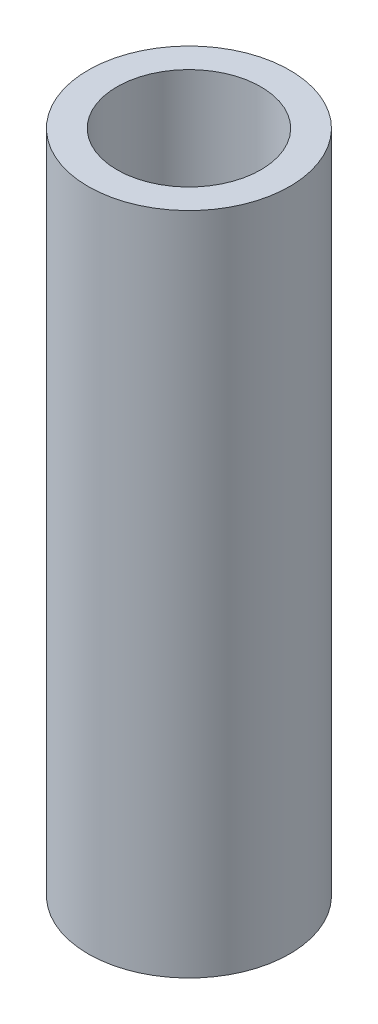
ISO-10303-21;
HEADER;
FILE_DESCRIPTION(('STEP AP214'),'2;1');
FILE_NAME('part.step','',(''),(''),'','','');
FILE_SCHEMA(('AUTOMOTIVE_DESIGN { 1 0 10303 214 1 1 1 1 }'));
ENDSEC;
DATA;
#1=APPLICATION_CONTEXT('core data for automotive mechanical design processes');
#2=APPLICATION_PROTOCOL_DEFINITION('international standard','automotive_design',2000,#1);
#3=PRODUCT_CONTEXT('',#1,'mechanical');
#4=PRODUCT('Part','Part','',(#3));
#5=PRODUCT_RELATED_PRODUCT_CATEGORY('part','',(#4));
#6=PRODUCT_DEFINITION_FORMATION('','',#4);
#7=PRODUCT_DEFINITION_CONTEXT('part definition',#1,'design');
#8=PRODUCT_DEFINITION('design','',#6,#7);
#9=PRODUCT_DEFINITION_SHAPE('','',#8);
#10=(LENGTH_UNIT() NAMED_UNIT(*) SI_UNIT(.MILLI.,.METRE.));
#11=(NAMED_UNIT(*) PLANE_ANGLE_UNIT() SI_UNIT($,.RADIAN.));
#12=(NAMED_UNIT(*) SI_UNIT($,.STERADIAN.) SOLID_ANGLE_UNIT());
#13=UNCERTAINTY_MEASURE_WITH_UNIT(LENGTH_MEASURE(1.E-05),#10,'distance_accuracy_value','');
#14=(GEOMETRIC_REPRESENTATION_CONTEXT(3) GLOBAL_UNCERTAINTY_ASSIGNED_CONTEXT((#13)) GLOBAL_UNIT_ASSIGNED_CONTEXT((#10,
#11,#12)) REPRESENTATION_CONTEXT('',''));
#15=CARTESIAN_POINT('',(0.,0.,0.));
#16=DIRECTION('',(0.,0.,1.));
#17=DIRECTION('',(1.,0.,0.));
#18=AXIS2_PLACEMENT_3D('',#15,#16,#17);
#19=CARTESIAN_POINT('',(0.,30.1498,0.));
#20=DIRECTION('',(0.,1.,0.));
#21=DIRECTION('',(0.,0.,1.));
#22=AXIS2_PLACEMENT_3D('',#19,#20,#21);
#23=PLANE('',#22);
#24=CARTESIAN_POINT('',(0.,30.1498,0.));
#25=DIRECTION('',(0.,1.,0.));
#26=DIRECTION('',(0.,0.,1.));
#27=AXIS2_PLACEMENT_3D('',#24,#25,#26);
#28=CIRCLE('',#27,4.572);
#29=CARTESIAN_POINT('',(0.,30.1498,4.572));
#30=VERTEX_POINT('',#29);
#31=EDGE_CURVE('E10',#30,#30,#28,.T.);
#32=ORIENTED_EDGE('',*,*,#31,.T.);
#33=EDGE_LOOP('',(#32));
#34=FACE_BOUND('',#33,.T.);
#35=CARTESIAN_POINT('',(0.,30.1498,0.));
#36=DIRECTION('',(0.,1.,0.));
#37=DIRECTION('',(0.,0.,1.));
#38=AXIS2_PLACEMENT_3D('',#35,#36,#37);
#39=CIRCLE('',#38,3.2639);
#40=CARTESIAN_POINT('',(0.,30.1498,3.2639));
#41=VERTEX_POINT('',#40);
#42=EDGE_CURVE('E42',#41,#41,#39,.T.);
#43=ORIENTED_EDGE('',*,*,#42,.F.);
#44=EDGE_LOOP('',(#43));
#45=FACE_BOUND('',#44,.T.);
#46=ADVANCED_FACE('F31',(#34,#45),#23,.T.);
#47=CARTESIAN_POINT('',(0.,0.,0.));
#48=DIRECTION('',(0.,1.,0.));
#49=DIRECTION('',(0.,0.,1.));
#50=AXIS2_PLACEMENT_3D('',#47,#48,#49);
#51=PLANE('',#50);
#52=CARTESIAN_POINT('',(0.,0.,0.));
#53=DIRECTION('',(0.,1.,0.));
#54=DIRECTION('',(0.,0.,1.));
#55=AXIS2_PLACEMENT_3D('',#52,#53,#54);
#56=CIRCLE('',#55,4.572);
#57=CARTESIAN_POINT('',(0.,0.,4.572));
#58=VERTEX_POINT('',#57);
#59=EDGE_CURVE('E35',#58,#58,#56,.T.);
#60=ORIENTED_EDGE('',*,*,#59,.F.);
#61=EDGE_LOOP('',(#60));
#62=FACE_BOUND('',#61,.T.);
#63=CARTESIAN_POINT('',(0.,0.,0.));
#64=DIRECTION('',(0.,1.,0.));
#65=DIRECTION('',(0.,0.,1.));
#66=AXIS2_PLACEMENT_3D('',#63,#64,#65);
#67=CIRCLE('',#66,3.2639);
#68=CARTESIAN_POINT('',(0.,0.,3.2639));
#69=VERTEX_POINT('',#68);
#70=EDGE_CURVE('E44',#69,#69,#67,.T.);
#71=ORIENTED_EDGE('',*,*,#70,.T.);
#72=EDGE_LOOP('',(#71));
#73=FACE_BOUND('',#72,.T.);
#74=ADVANCED_FACE('F54',(#62,#73),#51,.F.);
#75=CARTESIAN_POINT('',(0.,30.1498,0.));
#76=DIRECTION('',(0.,-1.,0.));
#77=DIRECTION('',(0.,0.,-1.));
#78=AXIS2_PLACEMENT_3D('',#75,#76,#77);
#79=CYLINDRICAL_SURFACE('',#78,4.572);
#80=ORIENTED_EDGE('',*,*,#31,.F.);
#81=EDGE_LOOP('',(#80));
#82=FACE_BOUND('',#81,.T.);
#83=ORIENTED_EDGE('',*,*,#59,.T.);
#84=EDGE_LOOP('',(#83));
#85=FACE_BOUND('',#84,.T.);
#86=ADVANCED_FACE('F33',(#82,#85),#79,.T.);
#87=CARTESIAN_POINT('',(0.,30.1498,0.));
#88=DIRECTION('',(0.,-1.,0.));
#89=DIRECTION('',(0.,0.,-1.));
#90=AXIS2_PLACEMENT_3D('',#87,#88,#89);
#91=CYLINDRICAL_SURFACE('',#90,3.2639);
#92=ORIENTED_EDGE('',*,*,#42,.T.);
#93=EDGE_LOOP('',(#92));
#94=FACE_BOUND('',#93,.T.);
#95=ORIENTED_EDGE('',*,*,#70,.F.);
#96=EDGE_LOOP('',(#95));
#97=FACE_BOUND('',#96,.T.);
#98=ADVANCED_FACE('F50',(#94,#97),#91,.F.);
#99=CLOSED_SHELL('',(#46,#74,#86,#98));
#100=MANIFOLD_SOLID_BREP('B2',#99);
#101=ADVANCED_BREP_SHAPE_REPRESENTATION('',(#18,#100),#14);
#102=SHAPE_DEFINITION_REPRESENTATION(#9,#101);
ENDSEC;
END-ISO-10303-21;
